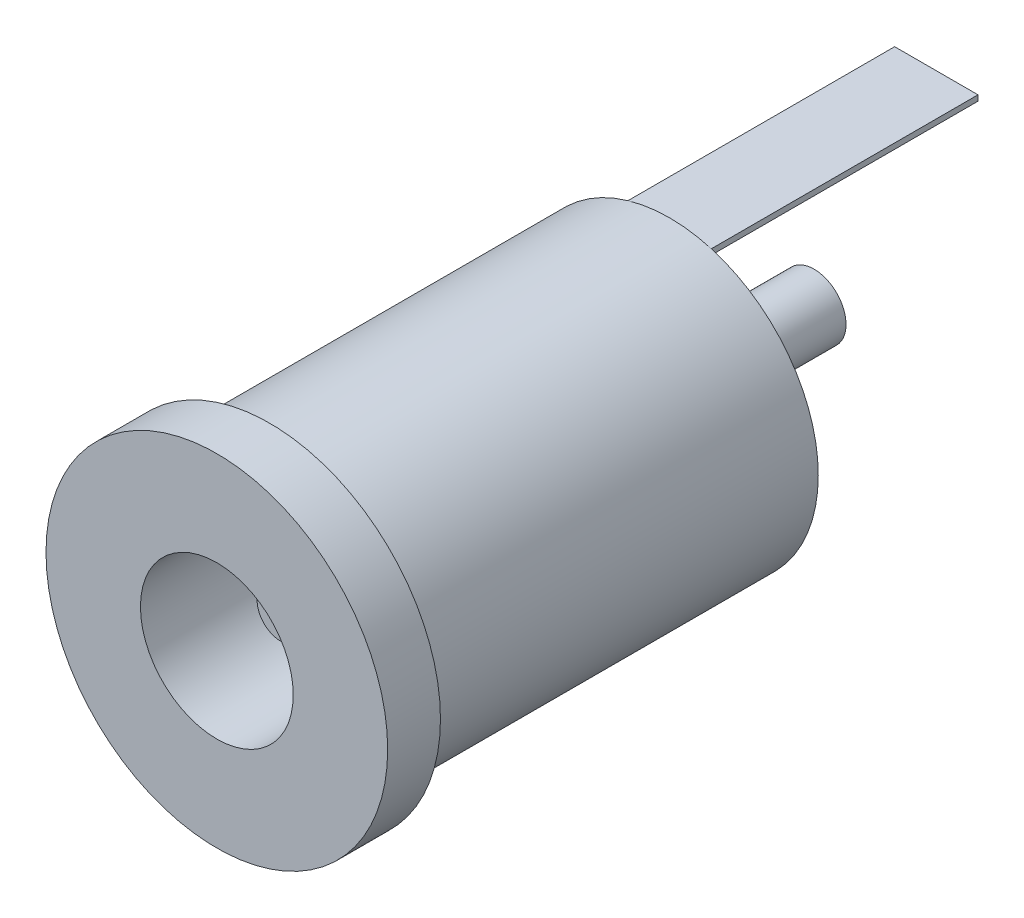
ISO-10303-21;
HEADER;
FILE_DESCRIPTION(('STEP AP214'),'2;1');
FILE_NAME('part.step','',(''),(''),'','','');
FILE_SCHEMA(('AUTOMOTIVE_DESIGN { 1 0 10303 214 1 1 1 1 }'));
ENDSEC;
DATA;
#1=APPLICATION_CONTEXT('core data for automotive mechanical design processes');
#2=APPLICATION_PROTOCOL_DEFINITION('international standard','automotive_design',2000,#1);
#3=PRODUCT_CONTEXT('',#1,'mechanical');
#4=PRODUCT('Part','Part','',(#3));
#5=PRODUCT_RELATED_PRODUCT_CATEGORY('part','',(#4));
#6=PRODUCT_DEFINITION_FORMATION('','',#4);
#7=PRODUCT_DEFINITION_CONTEXT('part definition',#1,'design');
#8=PRODUCT_DEFINITION('design','',#6,#7);
#9=PRODUCT_DEFINITION_SHAPE('','',#8);
#10=(LENGTH_UNIT() NAMED_UNIT(*) SI_UNIT(.MILLI.,.METRE.));
#11=(NAMED_UNIT(*) PLANE_ANGLE_UNIT() SI_UNIT($,.RADIAN.));
#12=(NAMED_UNIT(*) SI_UNIT($,.STERADIAN.) SOLID_ANGLE_UNIT());
#13=UNCERTAINTY_MEASURE_WITH_UNIT(LENGTH_MEASURE(1.E-05),#10,'distance_accuracy_value','');
#14=(GEOMETRIC_REPRESENTATION_CONTEXT(3) GLOBAL_UNCERTAINTY_ASSIGNED_CONTEXT((#13)) GLOBAL_UNIT_ASSIGNED_CONTEXT((#10,
#11,#12)) REPRESENTATION_CONTEXT('',''));
#15=CARTESIAN_POINT('',(0.,0.,0.));
#16=DIRECTION('',(0.,0.,1.));
#17=DIRECTION('',(1.,0.,0.));
#18=AXIS2_PLACEMENT_3D('',#15,#16,#17);
#19=CARTESIAN_POINT('',(0.,0.,-14.4));
#20=DIRECTION('',(0.,0.,1.));
#21=DIRECTION('',(1.,0.,0.));
#22=AXIS2_PLACEMENT_3D('',#19,#20,#21);
#23=PLANE('',#22);
#24=CARTESIAN_POINT('',(0.,0.,-14.4));
#25=DIRECTION('',(0.,0.,-1.));
#26=DIRECTION('',(-1.,0.,0.));
#27=AXIS2_PLACEMENT_3D('',#24,#25,#26);
#28=CIRCLE('',#27,1.9);
#29=CARTESIAN_POINT('',(-1.9,0.,-14.4));
#30=VERTEX_POINT('',#29);
#31=EDGE_CURVE('E11',#30,#30,#28,.T.);
#32=ORIENTED_EDGE('',*,*,#31,.F.);
#33=EDGE_LOOP('',(#32));
#34=FACE_BOUND('',#33,.T.);
#35=DIRECTION('',(0.,-1.,0.));
#36=VECTOR('',#35,1.);
#37=CARTESIAN_POINT('',(1.5,5.13541624408382,-14.4));
#38=LINE('',#37,#36);
#39=CARTESIAN_POINT('',(1.5,5.13541624408382,-14.4));
#40=VERTEX_POINT('',#39);
#41=CARTESIAN_POINT('',(1.5,4.93541624408382,-14.4));
#42=VERTEX_POINT('',#41);
#43=EDGE_CURVE('E109',#40,#42,#38,.T.);
#44=ORIENTED_EDGE('',*,*,#43,.F.);
#45=CARTESIAN_POINT('',(0.,0.,-14.4));
#46=DIRECTION('',(0.,0.,1.));
#47=DIRECTION('',(1.,0.,0.));
#48=AXIS2_PLACEMENT_3D('',#45,#46,#47);
#49=CIRCLE('',#48,5.35);
#50=CARTESIAN_POINT('',(-1.5,5.13541624408382,-14.4));
#51=VERTEX_POINT('',#50);
#52=EDGE_CURVE('E137',#51,#40,#49,.T.);
#53=ORIENTED_EDGE('',*,*,#52,.F.);
#54=DIRECTION('',(0.,-1.,0.));
#55=VECTOR('',#54,1.);
#56=CARTESIAN_POINT('',(-1.5,5.13541624408382,-14.4));
#57=LINE('',#56,#55);
#58=CARTESIAN_POINT('',(-1.5,4.93541624408382,-14.4));
#59=VERTEX_POINT('',#58);
#60=EDGE_CURVE('E56',#51,#59,#57,.T.);
#61=ORIENTED_EDGE('',*,*,#60,.T.);
#62=DIRECTION('',(-1.,0.,0.));
#63=VECTOR('',#62,1.);
#64=CARTESIAN_POINT('',(1.5,4.93541624408382,-14.4));
#65=LINE('',#64,#63);
#66=EDGE_CURVE('E99',#42,#59,#65,.T.);
#67=ORIENTED_EDGE('',*,*,#66,.F.);
#68=EDGE_LOOP('',(#44,#53,#61,#67));
#69=FACE_BOUND('',#68,.T.);
#70=ADVANCED_FACE('F39',(#34,#69),#23,.F.);
#71=CARTESIAN_POINT('',(0.,0.,1.9));
#72=DIRECTION('',(0.,0.,-1.));
#73=DIRECTION('',(-1.,0.,0.));
#74=AXIS2_PLACEMENT_3D('',#71,#72,#73);
#75=CYLINDRICAL_SURFACE('',#74,2.75);
#76=CARTESIAN_POINT('',(0.,0.,1.9));
#77=DIRECTION('',(0.,0.,1.));
#78=DIRECTION('',(1.,0.,0.));
#79=AXIS2_PLACEMENT_3D('',#76,#77,#78);
#80=CIRCLE('',#79,2.75);
#81=CARTESIAN_POINT('',(2.75,0.,1.9));
#82=VERTEX_POINT('',#81);
#83=EDGE_CURVE('E48',#82,#82,#80,.T.);
#84=ORIENTED_EDGE('',*,*,#83,.T.);
#85=EDGE_LOOP('',(#84));
#86=FACE_BOUND('',#85,.T.);
#87=CARTESIAN_POINT('',(0.,0.,-11.4));
#88=DIRECTION('',(0.,0.,-1.));
#89=DIRECTION('',(-1.,0.,0.));
#90=AXIS2_PLACEMENT_3D('',#87,#88,#89);
#91=CIRCLE('',#90,2.75);
#92=CARTESIAN_POINT('',(-2.75,0.,-11.4));
#93=VERTEX_POINT('',#92);
#94=EDGE_CURVE('E128',#93,#93,#91,.T.);
#95=ORIENTED_EDGE('',*,*,#94,.T.);
#96=EDGE_LOOP('',(#95));
#97=FACE_BOUND('',#96,.T.);
#98=ADVANCED_FACE('F169',(#86,#97),#75,.F.);
#99=CARTESIAN_POINT('',(0.,0.,1.9));
#100=DIRECTION('',(0.,0.,-1.));
#101=DIRECTION('',(-1.,0.,0.));
#102=AXIS2_PLACEMENT_3D('',#99,#100,#101);
#103=CYLINDRICAL_SURFACE('',#102,6.15);
#104=CARTESIAN_POINT('',(0.,0.,1.9));
#105=DIRECTION('',(0.,0.,1.));
#106=DIRECTION('',(1.,0.,0.));
#107=AXIS2_PLACEMENT_3D('',#104,#105,#106);
#108=CIRCLE('',#107,6.15);
#109=CARTESIAN_POINT('',(6.15,0.,1.9));
#110=VERTEX_POINT('',#109);
#111=EDGE_CURVE('E140',#110,#110,#108,.T.);
#112=ORIENTED_EDGE('',*,*,#111,.F.);
#113=EDGE_LOOP('',(#112));
#114=FACE_BOUND('',#113,.T.);
#115=CARTESIAN_POINT('',(0.,0.,0.));
#116=DIRECTION('',(0.,0.,1.));
#117=DIRECTION('',(1.,0.,0.));
#118=AXIS2_PLACEMENT_3D('',#115,#116,#117);
#119=CIRCLE('',#118,6.15);
#120=CARTESIAN_POINT('',(6.15,0.,0.));
#121=VERTEX_POINT('',#120);
#122=EDGE_CURVE('E136',#121,#121,#119,.T.);
#123=ORIENTED_EDGE('',*,*,#122,.T.);
#124=EDGE_LOOP('',(#123));
#125=FACE_BOUND('',#124,.T.);
#126=ADVANCED_FACE('F41',(#114,#125),#103,.T.);
#127=CARTESIAN_POINT('',(0.,0.,1.9));
#128=DIRECTION('',(0.,0.,1.));
#129=DIRECTION('',(1.,0.,0.));
#130=AXIS2_PLACEMENT_3D('',#127,#128,#129);
#131=PLANE('',#130);
#132=ORIENTED_EDGE('',*,*,#111,.T.);
#133=EDGE_LOOP('',(#132));
#134=FACE_BOUND('',#133,.T.);
#135=ORIENTED_EDGE('',*,*,#83,.F.);
#136=EDGE_LOOP('',(#135));
#137=FACE_BOUND('',#136,.T.);
#138=ADVANCED_FACE('F326',(#134,#137),#131,.T.);
#139=CARTESIAN_POINT('',(0.,0.,0.));
#140=DIRECTION('',(0.,0.,1.));
#141=DIRECTION('',(1.,0.,0.));
#142=AXIS2_PLACEMENT_3D('',#139,#140,#141);
#143=PLANE('',#142);
#144=CARTESIAN_POINT('',(0.,0.,0.));
#145=DIRECTION('',(0.,0.,1.));
#146=DIRECTION('',(1.,0.,0.));
#147=AXIS2_PLACEMENT_3D('',#144,#145,#146);
#148=CIRCLE('',#147,5.35);
#149=CARTESIAN_POINT('',(5.35,0.,0.));
#150=VERTEX_POINT('',#149);
#151=EDGE_CURVE('E132',#150,#150,#148,.T.);
#152=ORIENTED_EDGE('',*,*,#151,.T.);
#153=EDGE_LOOP('',(#152));
#154=FACE_BOUND('',#153,.T.);
#155=ORIENTED_EDGE('',*,*,#122,.F.);
#156=EDGE_LOOP('',(#155));
#157=FACE_BOUND('',#156,.T.);
#158=ADVANCED_FACE('F188',(#154,#157),#143,.F.);
#159=CARTESIAN_POINT('',(0.,0.,-14.4));
#160=DIRECTION('',(0.,0.,1.));
#161=DIRECTION('',(1.,0.,0.));
#162=AXIS2_PLACEMENT_3D('',#159,#160,#161);
#163=CYLINDRICAL_SURFACE('',#162,5.35);
#164=EDGE_CURVE('E133',#40,#51,#49,.T.);
#165=ORIENTED_EDGE('',*,*,#164,.T.);
#166=ORIENTED_EDGE('',*,*,#52,.T.);
#167=EDGE_LOOP('',(#165,#166));
#168=FACE_BOUND('',#167,.T.);
#169=ORIENTED_EDGE('',*,*,#151,.F.);
#170=EDGE_LOOP('',(#169));
#171=FACE_BOUND('',#170,.T.);
#172=ADVANCED_FACE('F182',(#168,#171),#163,.T.);
#173=ORIENTED_EDGE('',*,*,#164,.F.);
#174=DIRECTION('',(-1.,0.,0.));
#175=VECTOR('',#174,1.);
#176=CARTESIAN_POINT('',(1.5,5.13541624408382,-14.4));
#177=LINE('',#176,#175);
#178=EDGE_CURVE('E113',#40,#51,#177,.T.);
#179=ORIENTED_EDGE('',*,*,#178,.T.);
#180=EDGE_LOOP('',(#173,#179));
#181=FACE_BOUND('',#180,.T.);
#182=ADVANCED_FACE('F172',(#181),#23,.F.);
#183=CARTESIAN_POINT('',(0.,0.,-11.4));
#184=DIRECTION('',(0.,0.,-1.));
#185=DIRECTION('',(-1.,0.,0.));
#186=AXIS2_PLACEMENT_3D('',#183,#184,#185);
#187=PLANE('',#186);
#188=CARTESIAN_POINT('',(0.,0.,-11.4));
#189=DIRECTION('',(0.,0.,-1.));
#190=DIRECTION('',(-1.,0.,0.));
#191=AXIS2_PLACEMENT_3D('',#188,#189,#190);
#192=CIRCLE('',#191,0.85);
#193=CARTESIAN_POINT('',(-0.85,0.,-11.4));
#194=VERTEX_POINT('',#193);
#195=EDGE_CURVE('E125',#194,#194,#192,.T.);
#196=ORIENTED_EDGE('',*,*,#195,.T.);
#197=EDGE_LOOP('',(#196));
#198=FACE_BOUND('',#197,.T.);
#199=ORIENTED_EDGE('',*,*,#94,.F.);
#200=EDGE_LOOP('',(#199));
#201=FACE_BOUND('',#200,.T.);
#202=ADVANCED_FACE('F149',(#198,#201),#187,.F.);
#203=CARTESIAN_POINT('',(0.,0.,-15.2));
#204=DIRECTION('',(0.,0.,1.));
#205=DIRECTION('',(1.,0.,0.));
#206=AXIS2_PLACEMENT_3D('',#203,#204,#205);
#207=CYLINDRICAL_SURFACE('',#206,1.9);
#208=CARTESIAN_POINT('',(0.,0.,-15.2));
#209=DIRECTION('',(0.,0.,-1.));
#210=DIRECTION('',(-1.,0.,0.));
#211=AXIS2_PLACEMENT_3D('',#208,#209,#210);
#212=CIRCLE('',#211,1.9);
#213=CARTESIAN_POINT('',(-1.9,0.,-15.2));
#214=VERTEX_POINT('',#213);
#215=EDGE_CURVE('E126',#214,#214,#212,.T.);
#216=ORIENTED_EDGE('',*,*,#215,.F.);
#217=EDGE_LOOP('',(#216));
#218=FACE_BOUND('',#217,.T.);
#219=ORIENTED_EDGE('',*,*,#31,.T.);
#220=EDGE_LOOP('',(#219));
#221=FACE_BOUND('',#220,.T.);
#222=ADVANCED_FACE('F165',(#218,#221),#207,.T.);
#223=CARTESIAN_POINT('',(0.,0.,-15.2));
#224=DIRECTION('',(0.,0.,-1.));
#225=DIRECTION('',(-1.,0.,0.));
#226=AXIS2_PLACEMENT_3D('',#223,#224,#225);
#227=PLANE('',#226);
#228=CARTESIAN_POINT('',(0.,0.,-15.2));
#229=DIRECTION('',(0.,0.,-1.));
#230=DIRECTION('',(-1.,0.,0.));
#231=AXIS2_PLACEMENT_3D('',#228,#229,#230);
#232=CIRCLE('',#231,1.15);
#233=CARTESIAN_POINT('',(-1.15,0.,-15.2));
#234=VERTEX_POINT('',#233);
#235=EDGE_CURVE('E43',#234,#234,#232,.F.);
#236=ORIENTED_EDGE('',*,*,#235,.T.);
#237=EDGE_LOOP('',(#236));
#238=FACE_BOUND('',#237,.T.);
#239=ORIENTED_EDGE('',*,*,#215,.T.);
#240=EDGE_LOOP('',(#239));
#241=FACE_BOUND('',#240,.T.);
#242=ADVANCED_FACE('F155',(#238,#241),#227,.T.);
#243=CARTESIAN_POINT('',(0.,0.,-0.399999999999999));
#244=DIRECTION('',(0.,0.,-1.));
#245=DIRECTION('',(-1.,0.,0.));
#246=AXIS2_PLACEMENT_3D('',#243,#244,#245);
#247=CYLINDRICAL_SURFACE('',#246,0.85);
#248=CARTESIAN_POINT('',(0.,0.,-0.399999999999999));
#249=DIRECTION('',(0.,0.,-1.));
#250=DIRECTION('',(-1.,0.,0.));
#251=AXIS2_PLACEMENT_3D('',#248,#249,#250);
#252=CIRCLE('',#251,0.85);
#253=CARTESIAN_POINT('',(-0.85,0.,-0.399999999999999));
#254=VERTEX_POINT('',#253);
#255=EDGE_CURVE('E122',#254,#254,#252,.T.);
#256=ORIENTED_EDGE('',*,*,#255,.T.);
#257=EDGE_LOOP('',(#256));
#258=FACE_BOUND('',#257,.T.);
#259=ORIENTED_EDGE('',*,*,#195,.F.);
#260=EDGE_LOOP('',(#259));
#261=FACE_BOUND('',#260,.T.);
#262=ADVANCED_FACE('F152',(#258,#261),#247,.T.);
#263=CARTESIAN_POINT('',(0.,0.,-0.399999999999999));
#264=DIRECTION('',(0.,0.,-1.));
#265=DIRECTION('',(-1.,0.,0.));
#266=AXIS2_PLACEMENT_3D('',#263,#264,#265);
#267=PLANE('',#266);
#268=ORIENTED_EDGE('',*,*,#255,.F.);
#269=EDGE_LOOP('',(#268));
#270=FACE_BOUND('',#269,.T.);
#271=ADVANCED_FACE('F154',(#270),#267,.F.);
#272=CARTESIAN_POINT('',(0.,0.,-19.6));
#273=DIRECTION('',(0.,0.,1.));
#274=DIRECTION('',(1.,0.,0.));
#275=AXIS2_PLACEMENT_3D('',#272,#273,#274);
#276=CYLINDRICAL_SURFACE('',#275,1.15);
#277=ORIENTED_EDGE('',*,*,#235,.F.);
#278=EDGE_LOOP('',(#277));
#279=FACE_BOUND('',#278,.T.);
#280=CARTESIAN_POINT('',(0.,0.,-19.6));
#281=DIRECTION('',(0.,0.,-1.));
#282=DIRECTION('',(-1.,0.,0.));
#283=AXIS2_PLACEMENT_3D('',#280,#281,#282);
#284=CIRCLE('',#283,1.15);
#285=CARTESIAN_POINT('',(-1.15,0.,-19.6));
#286=VERTEX_POINT('',#285);
#287=EDGE_CURVE('E119',#286,#286,#284,.T.);
#288=ORIENTED_EDGE('',*,*,#287,.F.);
#289=EDGE_LOOP('',(#288));
#290=FACE_BOUND('',#289,.T.);
#291=ADVANCED_FACE('F162',(#279,#290),#276,.T.);
#292=CARTESIAN_POINT('',(0.,0.,-19.6));
#293=DIRECTION('',(0.,0.,-1.));
#294=DIRECTION('',(-1.,0.,0.));
#295=AXIS2_PLACEMENT_3D('',#292,#293,#294);
#296=PLANE('',#295);
#297=ORIENTED_EDGE('',*,*,#287,.T.);
#298=EDGE_LOOP('',(#297));
#299=FACE_BOUND('',#298,.T.);
#300=ADVANCED_FACE('F210',(#299),#296,.T.);
#301=CARTESIAN_POINT('',(1.5,5.13541624408382,-24.));
#302=DIRECTION('',(-1.,0.,0.));
#303=DIRECTION('',(0.,0.,1.));
#304=AXIS2_PLACEMENT_3D('',#301,#302,#303);
#305=PLANE('',#304);
#306=ORIENTED_EDGE('',*,*,#43,.T.);
#307=DIRECTION('',(0.,0.,1.));
#308=VECTOR('',#307,1.);
#309=CARTESIAN_POINT('',(1.5,4.93541624408382,-24.));
#310=LINE('',#309,#308);
#311=CARTESIAN_POINT('',(1.5,4.93541624408382,-24.));
#312=VERTEX_POINT('',#311);
#313=EDGE_CURVE('E100',#312,#42,#310,.T.);
#314=ORIENTED_EDGE('',*,*,#313,.F.);
#315=DIRECTION('',(0.,-1.,0.));
#316=VECTOR('',#315,1.);
#317=CARTESIAN_POINT('',(1.5,5.13541624408382,-24.));
#318=LINE('',#317,#316);
#319=CARTESIAN_POINT('',(1.5,5.13541624408382,-24.));
#320=VERTEX_POINT('',#319);
#321=EDGE_CURVE('E92',#320,#312,#318,.T.);
#322=ORIENTED_EDGE('',*,*,#321,.F.);
#323=DIRECTION('',(0.,0.,1.));
#324=VECTOR('',#323,1.);
#325=CARTESIAN_POINT('',(1.5,5.13541624408382,-24.));
#326=LINE('',#325,#324);
#327=EDGE_CURVE('E65',#320,#40,#326,.T.);
#328=ORIENTED_EDGE('',*,*,#327,.T.);
#329=EDGE_LOOP('',(#306,#314,#322,#328));
#330=FACE_BOUND('',#329,.T.);
#331=ADVANCED_FACE('F195',(#330),#305,.F.);
#332=CARTESIAN_POINT('',(1.5,4.93541624408382,-24.));
#333=DIRECTION('',(0.,1.,0.));
#334=DIRECTION('',(0.,0.,1.));
#335=AXIS2_PLACEMENT_3D('',#332,#333,#334);
#336=PLANE('',#335);
#337=ORIENTED_EDGE('',*,*,#66,.T.);
#338=DIRECTION('',(0.,0.,1.));
#339=VECTOR('',#338,1.);
#340=CARTESIAN_POINT('',(-1.5,4.93541624408382,-24.));
#341=LINE('',#340,#339);
#342=CARTESIAN_POINT('',(-1.5,4.93541624408382,-24.));
#343=VERTEX_POINT('',#342);
#344=EDGE_CURVE('E96',#343,#59,#341,.T.);
#345=ORIENTED_EDGE('',*,*,#344,.F.);
#346=DIRECTION('',(-1.,0.,0.));
#347=VECTOR('',#346,1.);
#348=CARTESIAN_POINT('',(1.5,4.93541624408382,-24.));
#349=LINE('',#348,#347);
#350=EDGE_CURVE('E84',#312,#343,#349,.T.);
#351=ORIENTED_EDGE('',*,*,#350,.F.);
#352=ORIENTED_EDGE('',*,*,#313,.T.);
#353=EDGE_LOOP('',(#337,#345,#351,#352));
#354=FACE_BOUND('',#353,.T.);
#355=ADVANCED_FACE('F97',(#354),#336,.F.);
#356=CARTESIAN_POINT('',(-1.5,5.13541624408382,-24.));
#357=DIRECTION('',(-1.,0.,0.));
#358=DIRECTION('',(0.,0.,1.));
#359=AXIS2_PLACEMENT_3D('',#356,#357,#358);
#360=PLANE('',#359);
#361=ORIENTED_EDGE('',*,*,#60,.F.);
#362=DIRECTION('',(0.,0.,1.));
#363=VECTOR('',#362,1.);
#364=CARTESIAN_POINT('',(-1.5,5.13541624408382,-24.));
#365=LINE('',#364,#363);
#366=CARTESIAN_POINT('',(-1.5,5.13541624408382,-24.));
#367=VERTEX_POINT('',#366);
#368=EDGE_CURVE('E101',#367,#51,#365,.T.);
#369=ORIENTED_EDGE('',*,*,#368,.F.);
#370=DIRECTION('',(0.,-1.,0.));
#371=VECTOR('',#370,1.);
#372=CARTESIAN_POINT('',(-1.5,5.13541624408382,-24.));
#373=LINE('',#372,#371);
#374=EDGE_CURVE('E91',#367,#343,#373,.T.);
#375=ORIENTED_EDGE('',*,*,#374,.T.);
#376=ORIENTED_EDGE('',*,*,#344,.T.);
#377=EDGE_LOOP('',(#361,#369,#375,#376));
#378=FACE_BOUND('',#377,.T.);
#379=ADVANCED_FACE('F103',(#378),#360,.T.);
#380=CARTESIAN_POINT('',(1.5,5.13541624408382,-24.));
#381=DIRECTION('',(0.,1.,0.));
#382=DIRECTION('',(0.,0.,1.));
#383=AXIS2_PLACEMENT_3D('',#380,#381,#382);
#384=PLANE('',#383);
#385=ORIENTED_EDGE('',*,*,#178,.F.);
#386=ORIENTED_EDGE('',*,*,#327,.F.);
#387=DIRECTION('',(-1.,0.,0.));
#388=VECTOR('',#387,1.);
#389=CARTESIAN_POINT('',(1.5,5.13541624408382,-24.));
#390=LINE('',#389,#388);
#391=EDGE_CURVE('E104',#320,#367,#390,.T.);
#392=ORIENTED_EDGE('',*,*,#391,.T.);
#393=ORIENTED_EDGE('',*,*,#368,.T.);
#394=EDGE_LOOP('',(#385,#386,#392,#393));
#395=FACE_BOUND('',#394,.T.);
#396=ADVANCED_FACE('F196',(#395),#384,.T.);
#397=CARTESIAN_POINT('',(0.,0.,-24.));
#398=DIRECTION('',(0.,0.,-1.));
#399=DIRECTION('',(-1.,0.,0.));
#400=AXIS2_PLACEMENT_3D('',#397,#398,#399);
#401=PLANE('',#400);
#402=ORIENTED_EDGE('',*,*,#321,.T.);
#403=ORIENTED_EDGE('',*,*,#350,.T.);
#404=ORIENTED_EDGE('',*,*,#374,.F.);
#405=ORIENTED_EDGE('',*,*,#391,.F.);
#406=EDGE_LOOP('',(#402,#403,#404,#405));
#407=FACE_BOUND('',#406,.T.);
#408=ADVANCED_FACE('F88',(#407),#401,.T.);
#409=CLOSED_SHELL('',(#70,#98,#126,#138,#158,#172,#182,#202,#222,#242,#262,#271,#291,#300,#331,
#355,#379,#396,#408));
#410=MANIFOLD_SOLID_BREP('B2',#409);
#411=ADVANCED_BREP_SHAPE_REPRESENTATION('',(#18,#410),#14);
#412=SHAPE_DEFINITION_REPRESENTATION(#9,#411);
ENDSEC;
END-ISO-10303-21;
